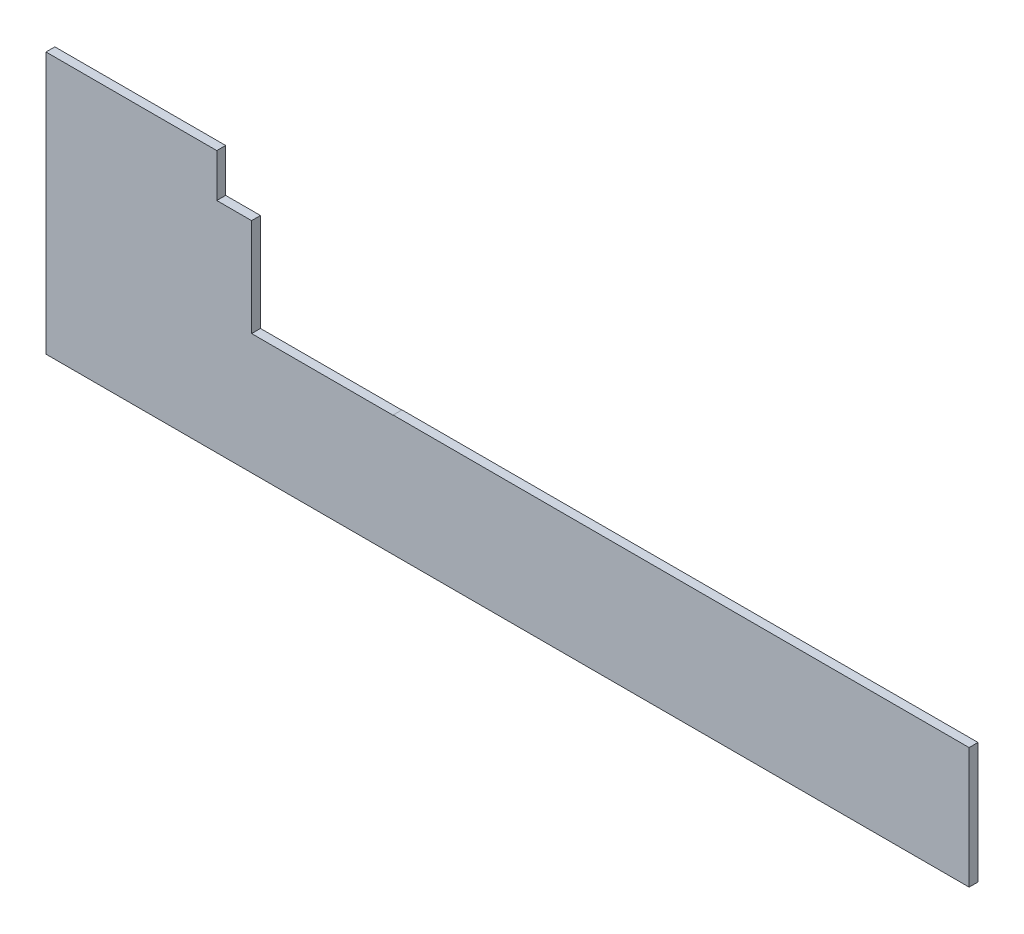
ISO-10303-21;
HEADER;
FILE_DESCRIPTION(('STEP AP214'),'2;1');
FILE_NAME('part.step','',(''),(''),'','','');
FILE_SCHEMA(('AUTOMOTIVE_DESIGN { 1 0 10303 214 1 1 1 1 }'));
ENDSEC;
DATA;
#1=APPLICATION_CONTEXT('core data for automotive mechanical design processes');
#2=APPLICATION_PROTOCOL_DEFINITION('international standard','automotive_design',2000,#1);
#3=PRODUCT_CONTEXT('',#1,'mechanical');
#4=PRODUCT('Part','Part','',(#3));
#5=PRODUCT_RELATED_PRODUCT_CATEGORY('part','',(#4));
#6=PRODUCT_DEFINITION_FORMATION('','',#4);
#7=PRODUCT_DEFINITION_CONTEXT('part definition',#1,'design');
#8=PRODUCT_DEFINITION('design','',#6,#7);
#9=PRODUCT_DEFINITION_SHAPE('','',#8);
#10=(LENGTH_UNIT() NAMED_UNIT(*) SI_UNIT(.MILLI.,.METRE.));
#11=(NAMED_UNIT(*) PLANE_ANGLE_UNIT() SI_UNIT($,.RADIAN.));
#12=(NAMED_UNIT(*) SI_UNIT($,.STERADIAN.) SOLID_ANGLE_UNIT());
#13=UNCERTAINTY_MEASURE_WITH_UNIT(LENGTH_MEASURE(1.E-05),#10,'distance_accuracy_value','');
#14=(GEOMETRIC_REPRESENTATION_CONTEXT(3) GLOBAL_UNCERTAINTY_ASSIGNED_CONTEXT((#13)) GLOBAL_UNIT_ASSIGNED_CONTEXT((#10,
#11,#12)) REPRESENTATION_CONTEXT('',''));
#15=CARTESIAN_POINT('',(0.,0.,0.));
#16=DIRECTION('',(0.,0.,1.));
#17=DIRECTION('',(1.,0.,0.));
#18=AXIS2_PLACEMENT_3D('',#15,#16,#17);
#19=CARTESIAN_POINT('',(0.,0.,-40.));
#20=DIRECTION('',(0.,0.,1.));
#21=DIRECTION('',(1.,0.,0.));
#22=AXIS2_PLACEMENT_3D('',#19,#20,#21);
#23=PLANE('',#22);
#24=DIRECTION('',(1.,0.,0.));
#25=VECTOR('',#24,1.);
#26=CARTESIAN_POINT('',(2040.,-992.,-40.));
#27=LINE('',#26,#25);
#28=CARTESIAN_POINT('',(1402.,-992.,-40.));
#29=VERTEX_POINT('',#28);
#30=CARTESIAN_POINT('',(2040.,-992.,-40.));
#31=VERTEX_POINT('',#30);
#32=EDGE_CURVE('E123',#29,#31,#27,.T.);
#33=ORIENTED_EDGE('',*,*,#32,.T.);
#34=DIRECTION('',(0.,1.,0.));
#35=VECTOR('',#34,1.);
#36=CARTESIAN_POINT('',(2040.,-551.,-40.));
#37=LINE('',#36,#35);
#38=CARTESIAN_POINT('',(2040.,-991.,-40.));
#39=VERTEX_POINT('',#38);
#40=EDGE_CURVE('E134',#31,#39,#37,.T.);
#41=ORIENTED_EDGE('',*,*,#40,.T.);
#42=DIRECTION('',(1.,0.,0.));
#43=VECTOR('',#42,1.);
#44=CARTESIAN_POINT('',(5297.,-991.,-40.));
#45=LINE('',#44,#43);
#46=CARTESIAN_POINT('',(4637.,-991.,-40.));
#47=VERTEX_POINT('',#46);
#48=EDGE_CURVE('E167',#39,#47,#45,.T.);
#49=ORIENTED_EDGE('',*,*,#48,.T.);
#50=DIRECTION('',(0.,-1.,0.));
#51=VECTOR('',#50,1.);
#52=CARTESIAN_POINT('',(4637.,-991.,-40.));
#53=LINE('',#52,#51);
#54=CARTESIAN_POINT('',(4637.,-1536.,-40.));
#55=VERTEX_POINT('',#54);
#56=EDGE_CURVE('E61',#47,#55,#53,.T.);
#57=ORIENTED_EDGE('',*,*,#56,.T.);
#58=DIRECTION('',(1.,0.,0.));
#59=VECTOR('',#58,1.);
#60=CARTESIAN_POINT('',(472.,-1536.,-40.));
#61=LINE('',#60,#59);
#62=CARTESIAN_POINT('',(475.,-1536.,-40.));
#63=VERTEX_POINT('',#62);
#64=EDGE_CURVE('E185',#63,#55,#61,.T.);
#65=ORIENTED_EDGE('',*,*,#64,.F.);
#66=DIRECTION('',(0.,-1.,0.));
#67=VECTOR('',#66,1.);
#68=CARTESIAN_POINT('',(475.,0.,-40.));
#69=LINE('',#68,#67);
#70=CARTESIAN_POINT('',(475.,-356.000000000001,-40.));
#71=VERTEX_POINT('',#70);
#72=EDGE_CURVE('E180',#71,#63,#69,.T.);
#73=ORIENTED_EDGE('',*,*,#72,.F.);
#74=DIRECTION('',(-1.,0.,0.));
#75=VECTOR('',#74,1.);
#76=CARTESIAN_POINT('',(0.,-356.000000000001,-40.));
#77=LINE('',#76,#75);
#78=CARTESIAN_POINT('',(1245.,-356.,-40.));
#79=VERTEX_POINT('',#78);
#80=EDGE_CURVE('E173',#79,#71,#77,.T.);
#81=ORIENTED_EDGE('',*,*,#80,.F.);
#82=DIRECTION('',(0.,-1.,0.));
#83=VECTOR('',#82,1.);
#84=CARTESIAN_POINT('',(1245.,-356.,-40.));
#85=LINE('',#84,#83);
#86=CARTESIAN_POINT('',(1245.,-551.,-40.));
#87=VERTEX_POINT('',#86);
#88=EDGE_CURVE('E143',#79,#87,#85,.T.);
#89=ORIENTED_EDGE('',*,*,#88,.T.);
#90=DIRECTION('',(1.,0.,0.));
#91=VECTOR('',#90,1.);
#92=CARTESIAN_POINT('',(2040.,-551.,-40.));
#93=LINE('',#92,#91);
#94=CARTESIAN_POINT('',(1402.,-551.,-40.));
#95=VERTEX_POINT('',#94);
#96=EDGE_CURVE('E133',#87,#95,#93,.T.);
#97=ORIENTED_EDGE('',*,*,#96,.T.);
#98=DIRECTION('',(0.,-1.,0.));
#99=VECTOR('',#98,1.);
#100=CARTESIAN_POINT('',(1402.,-551.,-40.));
#101=LINE('',#100,#99);
#102=EDGE_CURVE('E53',#95,#29,#101,.T.);
#103=ORIENTED_EDGE('',*,*,#102,.T.);
#104=EDGE_LOOP('',(#33,#41,#49,#57,#65,#73,#81,#89,#97,#103));
#105=FACE_BOUND('',#104,.T.);
#106=ADVANCED_FACE('F38',(#105),#23,.F.);
#107=CARTESIAN_POINT('',(0.,0.,0.));
#108=DIRECTION('',(0.,0.,1.));
#109=DIRECTION('',(1.,0.,0.));
#110=AXIS2_PLACEMENT_3D('',#107,#108,#109);
#111=PLANE('',#110);
#112=DIRECTION('',(0.,1.,0.));
#113=VECTOR('',#112,1.);
#114=CARTESIAN_POINT('',(2040.,0.,0.));
#115=LINE('',#114,#113);
#116=CARTESIAN_POINT('',(2040.,-992.,0.));
#117=VERTEX_POINT('',#116);
#118=CARTESIAN_POINT('',(2040.,-991.,0.));
#119=VERTEX_POINT('',#118);
#120=EDGE_CURVE('E141',#117,#119,#115,.T.);
#121=ORIENTED_EDGE('',*,*,#120,.F.);
#122=DIRECTION('',(1.,0.,0.));
#123=VECTOR('',#122,1.);
#124=CARTESIAN_POINT('',(0.,-992.,0.));
#125=LINE('',#124,#123);
#126=CARTESIAN_POINT('',(1402.,-992.,0.));
#127=VERTEX_POINT('',#126);
#128=EDGE_CURVE('E11',#127,#117,#125,.T.);
#129=ORIENTED_EDGE('',*,*,#128,.F.);
#130=DIRECTION('',(0.,-1.,0.));
#131=VECTOR('',#130,1.);
#132=CARTESIAN_POINT('',(1402.,0.,0.));
#133=LINE('',#132,#131);
#134=CARTESIAN_POINT('',(1402.,-551.,0.));
#135=VERTEX_POINT('',#134);
#136=EDGE_CURVE('E116',#135,#127,#133,.T.);
#137=ORIENTED_EDGE('',*,*,#136,.F.);
#138=DIRECTION('',(1.,0.,0.));
#139=VECTOR('',#138,1.);
#140=CARTESIAN_POINT('',(1.53895065803387E-13,-551.,0.));
#141=LINE('',#140,#139);
#142=CARTESIAN_POINT('',(1245.,-551.,0.));
#143=VERTEX_POINT('',#142);
#144=EDGE_CURVE('E151',#143,#135,#141,.T.);
#145=ORIENTED_EDGE('',*,*,#144,.F.);
#146=DIRECTION('',(0.,-1.,0.));
#147=VECTOR('',#146,1.);
#148=CARTESIAN_POINT('',(1245.,0.,0.));
#149=LINE('',#148,#147);
#150=CARTESIAN_POINT('',(1245.,-356.,0.));
#151=VERTEX_POINT('',#150);
#152=EDGE_CURVE('E162',#151,#143,#149,.T.);
#153=ORIENTED_EDGE('',*,*,#152,.F.);
#154=DIRECTION('',(-1.,0.,0.));
#155=VECTOR('',#154,1.);
#156=CARTESIAN_POINT('',(0.,-356.000000000001,0.));
#157=LINE('',#156,#155);
#158=CARTESIAN_POINT('',(475.,-356.000000000001,0.));
#159=VERTEX_POINT('',#158);
#160=EDGE_CURVE('E178',#151,#159,#157,.T.);
#161=ORIENTED_EDGE('',*,*,#160,.T.);
#162=DIRECTION('',(0.,-1.,0.));
#163=VECTOR('',#162,1.);
#164=CARTESIAN_POINT('',(475.,0.,0.));
#165=LINE('',#164,#163);
#166=CARTESIAN_POINT('',(475.,-1536.,0.));
#167=VERTEX_POINT('',#166);
#168=EDGE_CURVE('E46',#159,#167,#165,.T.);
#169=ORIENTED_EDGE('',*,*,#168,.T.);
#170=DIRECTION('',(1.,0.,0.));
#171=VECTOR('',#170,1.);
#172=CARTESIAN_POINT('',(472.,-1536.,0.));
#173=LINE('',#172,#171);
#174=CARTESIAN_POINT('',(4637.,-1536.,0.));
#175=VERTEX_POINT('',#174);
#176=EDGE_CURVE('E184',#167,#175,#173,.T.);
#177=ORIENTED_EDGE('',*,*,#176,.T.);
#178=DIRECTION('',(0.,-1.,0.));
#179=VECTOR('',#178,1.);
#180=CARTESIAN_POINT('',(4637.,0.,0.));
#181=LINE('',#180,#179);
#182=CARTESIAN_POINT('',(4637.,-991.,0.));
#183=VERTEX_POINT('',#182);
#184=EDGE_CURVE('E160',#183,#175,#181,.T.);
#185=ORIENTED_EDGE('',*,*,#184,.F.);
#186=DIRECTION('',(1.,0.,0.));
#187=VECTOR('',#186,1.);
#188=CARTESIAN_POINT('',(0.,-991.,0.));
#189=LINE('',#188,#187);
#190=EDGE_CURVE('E170',#119,#183,#189,.T.);
#191=ORIENTED_EDGE('',*,*,#190,.F.);
#192=EDGE_LOOP('',(#121,#129,#137,#145,#153,#161,#169,#177,#185,#191));
#193=FACE_BOUND('',#192,.T.);
#194=ADVANCED_FACE('F194',(#193),#111,.T.);
#195=CARTESIAN_POINT('',(472.,-1536.,-40.));
#196=DIRECTION('',(0.,-1.,0.));
#197=DIRECTION('',(0.,0.,-1.));
#198=AXIS2_PLACEMENT_3D('',#195,#196,#197);
#199=PLANE('',#198);
#200=DIRECTION('',(0.,0.,1.));
#201=VECTOR('',#200,1.);
#202=CARTESIAN_POINT('',(4637.,-1536.,-40.));
#203=LINE('',#202,#201);
#204=EDGE_CURVE('E145',#55,#175,#203,.T.);
#205=ORIENTED_EDGE('',*,*,#204,.T.);
#206=ORIENTED_EDGE('',*,*,#176,.F.);
#207=DIRECTION('',(0.,0.,1.));
#208=VECTOR('',#207,1.);
#209=CARTESIAN_POINT('',(475.,-1536.,-40.));
#210=LINE('',#209,#208);
#211=EDGE_CURVE('E182',#63,#167,#210,.T.);
#212=ORIENTED_EDGE('',*,*,#211,.F.);
#213=ORIENTED_EDGE('',*,*,#64,.T.);
#214=EDGE_LOOP('',(#205,#206,#212,#213));
#215=FACE_BOUND('',#214,.T.);
#216=ADVANCED_FACE('F40',(#215),#199,.T.);
#217=CARTESIAN_POINT('',(475.,0.,-40.));
#218=DIRECTION('',(-1.,0.,0.));
#219=DIRECTION('',(0.,-1.,0.));
#220=AXIS2_PLACEMENT_3D('',#217,#218,#219);
#221=PLANE('',#220);
#222=ORIENTED_EDGE('',*,*,#168,.F.);
#223=DIRECTION('',(0.,0.,1.));
#224=VECTOR('',#223,1.);
#225=CARTESIAN_POINT('',(475.,-356.000000000001,-40.));
#226=LINE('',#225,#224);
#227=EDGE_CURVE('E175',#71,#159,#226,.T.);
#228=ORIENTED_EDGE('',*,*,#227,.F.);
#229=ORIENTED_EDGE('',*,*,#72,.T.);
#230=ORIENTED_EDGE('',*,*,#211,.T.);
#231=EDGE_LOOP('',(#222,#228,#229,#230));
#232=FACE_BOUND('',#231,.T.);
#233=ADVANCED_FACE('F228',(#232),#221,.T.);
#234=CARTESIAN_POINT('',(0.,-356.000000000001,-40.));
#235=DIRECTION('',(0.,1.,0.));
#236=DIRECTION('',(-1.,0.,0.));
#237=AXIS2_PLACEMENT_3D('',#234,#235,#236);
#238=PLANE('',#237);
#239=DIRECTION('',(0.,0.,1.));
#240=VECTOR('',#239,1.);
#241=CARTESIAN_POINT('',(1245.,-356.,-40.));
#242=LINE('',#241,#240);
#243=EDGE_CURVE('E147',#79,#151,#242,.T.);
#244=ORIENTED_EDGE('',*,*,#243,.F.);
#245=ORIENTED_EDGE('',*,*,#80,.T.);
#246=ORIENTED_EDGE('',*,*,#227,.T.);
#247=ORIENTED_EDGE('',*,*,#160,.F.);
#248=EDGE_LOOP('',(#244,#245,#246,#247));
#249=FACE_BOUND('',#248,.T.);
#250=ADVANCED_FACE('F231',(#249),#238,.T.);
#251=CARTESIAN_POINT('',(5297.,-991.,-40.));
#252=DIRECTION('',(0.,-1.,0.));
#253=DIRECTION('',(1.,0.,0.));
#254=AXIS2_PLACEMENT_3D('',#251,#252,#253);
#255=PLANE('',#254);
#256=ORIENTED_EDGE('',*,*,#190,.T.);
#257=DIRECTION('',(0.,0.,1.));
#258=VECTOR('',#257,1.);
#259=CARTESIAN_POINT('',(4637.,-991.,-40.));
#260=LINE('',#259,#258);
#261=EDGE_CURVE('E154',#47,#183,#260,.T.);
#262=ORIENTED_EDGE('',*,*,#261,.F.);
#263=ORIENTED_EDGE('',*,*,#48,.F.);
#264=DIRECTION('',(0.,0.,1.));
#265=VECTOR('',#264,1.);
#266=CARTESIAN_POINT('',(2040.,-991.,-40.));
#267=LINE('',#266,#265);
#268=EDGE_CURVE('E164',#39,#119,#267,.T.);
#269=ORIENTED_EDGE('',*,*,#268,.T.);
#270=EDGE_LOOP('',(#256,#262,#263,#269));
#271=FACE_BOUND('',#270,.T.);
#272=ADVANCED_FACE('F207',(#271),#255,.F.);
#273=CARTESIAN_POINT('',(2040.,-551.,-40.));
#274=DIRECTION('',(0.,-1.,0.));
#275=DIRECTION('',(1.,0.,0.));
#276=AXIS2_PLACEMENT_3D('',#273,#274,#275);
#277=PLANE('',#276);
#278=ORIENTED_EDGE('',*,*,#144,.T.);
#279=DIRECTION('',(0.,0.,1.));
#280=VECTOR('',#279,1.);
#281=CARTESIAN_POINT('',(1402.,-551.,-40.));
#282=LINE('',#281,#280);
#283=EDGE_CURVE('E120',#95,#135,#282,.T.);
#284=ORIENTED_EDGE('',*,*,#283,.F.);
#285=ORIENTED_EDGE('',*,*,#96,.F.);
#286=DIRECTION('',(0.,0.,1.));
#287=VECTOR('',#286,1.);
#288=CARTESIAN_POINT('',(1245.,-551.,-40.));
#289=LINE('',#288,#287);
#290=EDGE_CURVE('E148',#87,#143,#289,.T.);
#291=ORIENTED_EDGE('',*,*,#290,.T.);
#292=EDGE_LOOP('',(#278,#284,#285,#291));
#293=FACE_BOUND('',#292,.T.);
#294=ADVANCED_FACE('F236',(#293),#277,.F.);
#295=CARTESIAN_POINT('',(1245.,-356.,-40.));
#296=DIRECTION('',(-1.,0.,0.));
#297=DIRECTION('',(0.,0.,1.));
#298=AXIS2_PLACEMENT_3D('',#295,#296,#297);
#299=PLANE('',#298);
#300=ORIENTED_EDGE('',*,*,#152,.T.);
#301=ORIENTED_EDGE('',*,*,#290,.F.);
#302=ORIENTED_EDGE('',*,*,#88,.F.);
#303=ORIENTED_EDGE('',*,*,#243,.T.);
#304=EDGE_LOOP('',(#300,#301,#302,#303));
#305=FACE_BOUND('',#304,.T.);
#306=ADVANCED_FACE('F218',(#305),#299,.F.);
#307=CARTESIAN_POINT('',(4637.,-991.,-40.));
#308=DIRECTION('',(-1.,0.,0.));
#309=DIRECTION('',(0.,0.,1.));
#310=AXIS2_PLACEMENT_3D('',#307,#308,#309);
#311=PLANE('',#310);
#312=ORIENTED_EDGE('',*,*,#184,.T.);
#313=ORIENTED_EDGE('',*,*,#204,.F.);
#314=ORIENTED_EDGE('',*,*,#56,.F.);
#315=ORIENTED_EDGE('',*,*,#261,.T.);
#316=EDGE_LOOP('',(#312,#313,#314,#315));
#317=FACE_BOUND('',#316,.T.);
#318=ADVANCED_FACE('F203',(#317),#311,.F.);
#319=CARTESIAN_POINT('',(2040.,-551.,-40.));
#320=DIRECTION('',(1.,0.,0.));
#321=DIRECTION('',(0.,0.,-1.));
#322=AXIS2_PLACEMENT_3D('',#319,#320,#321);
#323=PLANE('',#322);
#324=ORIENTED_EDGE('',*,*,#120,.T.);
#325=ORIENTED_EDGE('',*,*,#268,.F.);
#326=ORIENTED_EDGE('',*,*,#40,.F.);
#327=DIRECTION('',(0.,0.,1.));
#328=VECTOR('',#327,1.);
#329=CARTESIAN_POINT('',(2040.,-992.,-40.));
#330=LINE('',#329,#328);
#331=EDGE_CURVE('E119',#31,#117,#330,.T.);
#332=ORIENTED_EDGE('',*,*,#331,.T.);
#333=EDGE_LOOP('',(#324,#325,#326,#332));
#334=FACE_BOUND('',#333,.T.);
#335=ADVANCED_FACE('F210',(#334),#323,.F.);
#336=CARTESIAN_POINT('',(2040.,-992.,-40.));
#337=DIRECTION('',(0.,-1.,0.));
#338=DIRECTION('',(0.,0.,-1.));
#339=AXIS2_PLACEMENT_3D('',#336,#337,#338);
#340=PLANE('',#339);
#341=ORIENTED_EDGE('',*,*,#128,.T.);
#342=ORIENTED_EDGE('',*,*,#331,.F.);
#343=ORIENTED_EDGE('',*,*,#32,.F.);
#344=DIRECTION('',(0.,0.,1.));
#345=VECTOR('',#344,1.);
#346=CARTESIAN_POINT('',(1402.,-992.,-40.));
#347=LINE('',#346,#345);
#348=EDGE_CURVE('E112',#29,#127,#347,.T.);
#349=ORIENTED_EDGE('',*,*,#348,.T.);
#350=EDGE_LOOP('',(#341,#342,#343,#349));
#351=FACE_BOUND('',#350,.T.);
#352=ADVANCED_FACE('F124',(#351),#340,.F.);
#353=CARTESIAN_POINT('',(1402.,-551.,-40.));
#354=DIRECTION('',(-1.,0.,0.));
#355=DIRECTION('',(0.,0.,1.));
#356=AXIS2_PLACEMENT_3D('',#353,#354,#355);
#357=PLANE('',#356);
#358=ORIENTED_EDGE('',*,*,#136,.T.);
#359=ORIENTED_EDGE('',*,*,#348,.F.);
#360=ORIENTED_EDGE('',*,*,#102,.F.);
#361=ORIENTED_EDGE('',*,*,#283,.T.);
#362=EDGE_LOOP('',(#358,#359,#360,#361));
#363=FACE_BOUND('',#362,.T.);
#364=ADVANCED_FACE('F114',(#363),#357,.F.);
#365=CLOSED_SHELL('',(#106,#194,#216,#233,#250,#272,#294,#306,#318,#335,#352,#364));
#366=MANIFOLD_SOLID_BREP('B2',#365);
#367=ADVANCED_BREP_SHAPE_REPRESENTATION('',(#18,#366),#14);
#368=SHAPE_DEFINITION_REPRESENTATION(#9,#367);
ENDSEC;
END-ISO-10303-21;
